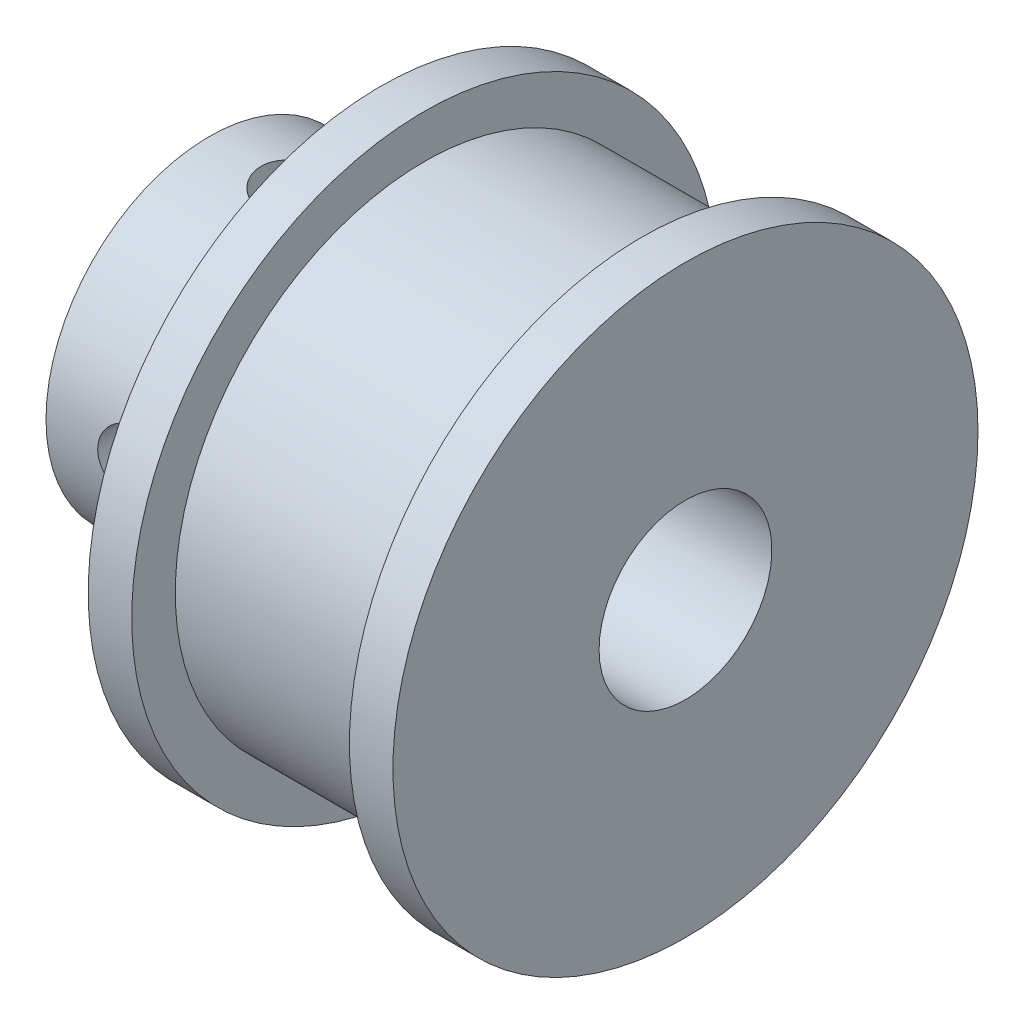
ISO-10303-21;
HEADER;
FILE_DESCRIPTION(('STEP AP214'),'2;1');
FILE_NAME('part.step','',(''),(''),'','','');
FILE_SCHEMA(('AUTOMOTIVE_DESIGN { 1 0 10303 214 1 1 1 1 }'));
ENDSEC;
DATA;
#1=APPLICATION_CONTEXT('core data for automotive mechanical design processes');
#2=APPLICATION_PROTOCOL_DEFINITION('international standard','automotive_design',2000,#1);
#3=PRODUCT_CONTEXT('',#1,'mechanical');
#4=PRODUCT('Part','Part','',(#3));
#5=PRODUCT_RELATED_PRODUCT_CATEGORY('part','',(#4));
#6=PRODUCT_DEFINITION_FORMATION('','',#4);
#7=PRODUCT_DEFINITION_CONTEXT('part definition',#1,'design');
#8=PRODUCT_DEFINITION('design','',#6,#7);
#9=PRODUCT_DEFINITION_SHAPE('','',#8);
#10=(LENGTH_UNIT() NAMED_UNIT(*) SI_UNIT(.MILLI.,.METRE.));
#11=(NAMED_UNIT(*) PLANE_ANGLE_UNIT() SI_UNIT($,.RADIAN.));
#12=(NAMED_UNIT(*) SI_UNIT($,.STERADIAN.) SOLID_ANGLE_UNIT());
#13=UNCERTAINTY_MEASURE_WITH_UNIT(LENGTH_MEASURE(1.E-05),#10,'distance_accuracy_value','');
#14=(GEOMETRIC_REPRESENTATION_CONTEXT(3) GLOBAL_UNCERTAINTY_ASSIGNED_CONTEXT((#13)) GLOBAL_UNIT_ASSIGNED_CONTEXT((#10,
#11,#12)) REPRESENTATION_CONTEXT('',''));
#15=CARTESIAN_POINT('',(0.,0.,0.));
#16=DIRECTION('',(0.,0.,1.));
#17=DIRECTION('',(1.,0.,0.));
#18=AXIS2_PLACEMENT_3D('',#15,#16,#17);
#19=CARTESIAN_POINT('',(6.3,0.,0.));
#20=DIRECTION('',(1.,0.,0.));
#21=DIRECTION('',(0.,0.,-1.));
#22=AXIS2_PLACEMENT_3D('',#19,#20,#21);
#23=CYLINDRICAL_SURFACE('',#22,10.75);
#24=CARTESIAN_POINT('',(6.3,0.,0.));
#25=DIRECTION('',(1.,0.,0.));
#26=DIRECTION('',(0.,0.,-1.));
#27=AXIS2_PLACEMENT_3D('',#24,#25,#26);
#28=CIRCLE('',#27,10.75);
#29=CARTESIAN_POINT('',(6.3,0.,-10.75));
#30=VERTEX_POINT('',#29);
#31=EDGE_CURVE('E54',#30,#30,#28,.T.);
#32=ORIENTED_EDGE('',*,*,#31,.T.);
#33=EDGE_LOOP('',(#32));
#34=FACE_BOUND('',#33,.T.);
#35=CARTESIAN_POINT('',(7.9,0.,0.));
#36=DIRECTION('',(1.,0.,0.));
#37=DIRECTION('',(0.,0.,-1.));
#38=AXIS2_PLACEMENT_3D('',#35,#36,#37);
#39=CIRCLE('',#38,10.75);
#40=CARTESIAN_POINT('',(7.9,0.,-10.75));
#41=VERTEX_POINT('',#40);
#42=EDGE_CURVE('E73',#41,#41,#39,.T.);
#43=ORIENTED_EDGE('',*,*,#42,.F.);
#44=EDGE_LOOP('',(#43));
#45=FACE_BOUND('',#44,.T.);
#46=ADVANCED_FACE('F44',(#34,#45),#23,.T.);
#47=CARTESIAN_POINT('',(6.3,10.75,0.));
#48=DIRECTION('',(-1.,0.,0.));
#49=DIRECTION('',(0.,0.,1.));
#50=AXIS2_PLACEMENT_3D('',#47,#48,#49);
#51=PLANE('',#50);
#52=CARTESIAN_POINT('',(6.3,0.,0.));
#53=DIRECTION('',(-1.,0.,0.));
#54=DIRECTION('',(0.,0.,1.));
#55=AXIS2_PLACEMENT_3D('',#52,#53,#54);
#56=CIRCLE('',#55,6.);
#57=CARTESIAN_POINT('',(6.3,0.,6.));
#58=VERTEX_POINT('',#57);
#59=EDGE_CURVE('E77',#58,#58,#56,.T.);
#60=ORIENTED_EDGE('',*,*,#59,.F.);
#61=EDGE_LOOP('',(#60));
#62=FACE_BOUND('',#61,.T.);
#63=ORIENTED_EDGE('',*,*,#31,.F.);
#64=EDGE_LOOP('',(#63));
#65=FACE_BOUND('',#64,.T.);
#66=ADVANCED_FACE('F126',(#62,#65),#51,.T.);
#67=CARTESIAN_POINT('',(17.5,0.,0.));
#68=DIRECTION('',(1.,0.,0.));
#69=DIRECTION('',(0.,0.,-1.));
#70=AXIS2_PLACEMENT_3D('',#67,#68,#69);
#71=PLANE('',#70);
#72=CARTESIAN_POINT('',(17.5,0.,0.));
#73=DIRECTION('',(-1.,0.,0.));
#74=DIRECTION('',(0.,0.,1.));
#75=AXIS2_PLACEMENT_3D('',#72,#73,#74);
#76=CIRCLE('',#75,3.17500000000001);
#77=CARTESIAN_POINT('',(17.5,0.,3.17500000000001));
#78=VERTEX_POINT('',#77);
#79=EDGE_CURVE('E80',#78,#78,#76,.T.);
#80=ORIENTED_EDGE('',*,*,#79,.T.);
#81=EDGE_LOOP('',(#80));
#82=FACE_BOUND('',#81,.T.);
#83=CARTESIAN_POINT('',(17.5,0.,0.));
#84=DIRECTION('',(1.,0.,0.));
#85=DIRECTION('',(0.,0.,-1.));
#86=AXIS2_PLACEMENT_3D('',#83,#84,#85);
#87=CIRCLE('',#86,10.75);
#88=CARTESIAN_POINT('',(17.5,0.,-10.75));
#89=VERTEX_POINT('',#88);
#90=EDGE_CURVE('E58',#89,#89,#87,.T.);
#91=ORIENTED_EDGE('',*,*,#90,.T.);
#92=EDGE_LOOP('',(#91));
#93=FACE_BOUND('',#92,.T.);
#94=ADVANCED_FACE('F130',(#82,#93),#71,.T.);
#95=CARTESIAN_POINT('',(6.3,0.,0.));
#96=DIRECTION('',(1.,0.,0.));
#97=DIRECTION('',(0.,0.,-1.));
#98=AXIS2_PLACEMENT_3D('',#95,#96,#97);
#99=CYLINDRICAL_SURFACE('',#98,10.75);
#100=CARTESIAN_POINT('',(15.9,0.,0.));
#101=DIRECTION('',(1.,0.,0.));
#102=DIRECTION('',(0.,0.,-1.));
#103=AXIS2_PLACEMENT_3D('',#100,#101,#102);
#104=CIRCLE('',#103,10.75);
#105=CARTESIAN_POINT('',(15.9,0.,-10.75));
#106=VERTEX_POINT('',#105);
#107=EDGE_CURVE('E62',#106,#106,#104,.T.);
#108=ORIENTED_EDGE('',*,*,#107,.T.);
#109=EDGE_LOOP('',(#108));
#110=FACE_BOUND('',#109,.T.);
#111=ORIENTED_EDGE('',*,*,#90,.F.);
#112=EDGE_LOOP('',(#111));
#113=FACE_BOUND('',#112,.T.);
#114=ADVANCED_FACE('F148',(#110,#113),#99,.T.);
#115=CARTESIAN_POINT('',(15.9,10.75,0.));
#116=DIRECTION('',(-1.,0.,0.));
#117=DIRECTION('',(0.,0.,1.));
#118=AXIS2_PLACEMENT_3D('',#115,#116,#117);
#119=PLANE('',#118);
#120=CARTESIAN_POINT('',(15.9,0.,0.));
#121=DIRECTION('',(1.,0.,0.));
#122=DIRECTION('',(0.,0.,-1.));
#123=AXIS2_PLACEMENT_3D('',#120,#121,#122);
#124=CIRCLE('',#123,9.15);
#125=CARTESIAN_POINT('',(15.9,0.,-9.15));
#126=VERTEX_POINT('',#125);
#127=EDGE_CURVE('E67',#126,#126,#124,.T.);
#128=ORIENTED_EDGE('',*,*,#127,.T.);
#129=EDGE_LOOP('',(#128));
#130=FACE_BOUND('',#129,.T.);
#131=ORIENTED_EDGE('',*,*,#107,.F.);
#132=EDGE_LOOP('',(#131));
#133=FACE_BOUND('',#132,.T.);
#134=ADVANCED_FACE('F142',(#130,#133),#119,.T.);
#135=CARTESIAN_POINT('',(6.3,0.,0.));
#136=DIRECTION('',(1.,0.,0.));
#137=DIRECTION('',(0.,0.,-1.));
#138=AXIS2_PLACEMENT_3D('',#135,#136,#137);
#139=CYLINDRICAL_SURFACE('',#138,9.15);
#140=CARTESIAN_POINT('',(7.9,0.,0.));
#141=DIRECTION('',(1.,0.,0.));
#142=DIRECTION('',(0.,0.,-1.));
#143=AXIS2_PLACEMENT_3D('',#140,#141,#142);
#144=CIRCLE('',#143,9.15);
#145=CARTESIAN_POINT('',(7.9,0.,-9.15));
#146=VERTEX_POINT('',#145);
#147=EDGE_CURVE('E70',#146,#146,#144,.T.);
#148=ORIENTED_EDGE('',*,*,#147,.T.);
#149=EDGE_LOOP('',(#148));
#150=FACE_BOUND('',#149,.T.);
#151=ORIENTED_EDGE('',*,*,#127,.F.);
#152=EDGE_LOOP('',(#151));
#153=FACE_BOUND('',#152,.T.);
#154=ADVANCED_FACE('F137',(#150,#153),#139,.T.);
#155=CARTESIAN_POINT('',(7.9,9.15000000000001,0.));
#156=DIRECTION('',(1.,0.,0.));
#157=DIRECTION('',(0.,0.,-1.));
#158=AXIS2_PLACEMENT_3D('',#155,#156,#157);
#159=PLANE('',#158);
#160=ORIENTED_EDGE('',*,*,#42,.T.);
#161=EDGE_LOOP('',(#160));
#162=FACE_BOUND('',#161,.T.);
#163=ORIENTED_EDGE('',*,*,#147,.F.);
#164=EDGE_LOOP('',(#163));
#165=FACE_BOUND('',#164,.T.);
#166=ADVANCED_FACE('F121',(#162,#165),#159,.T.);
#167=CARTESIAN_POINT('',(0.,0.,0.));
#168=DIRECTION('',(1.,0.,0.));
#169=DIRECTION('',(0.,0.,-1.));
#170=AXIS2_PLACEMENT_3D('',#167,#168,#169);
#171=CYLINDRICAL_SURFACE('',#170,6.);
#172=CARTESIAN_POINT('',(3.15,-1.24999999999999,5.86834729715276));
#173=CARTESIAN_POINT('',(3.08060938484897,-1.24999750877598,5.86834869213646));
#174=CARTESIAN_POINT('',(3.01118802798478,-1.24420229433947,5.86959145924544));
#175=CARTESIAN_POINT('',(2.87431368268276,-1.22119649233777,5.87442015581798));
#176=CARTESIAN_POINT('',(2.80686224449358,-1.2039771544034,5.87800788138389));
#177=CARTESIAN_POINT('',(2.67592762716514,-1.15868397507228,5.88710292961931));
#178=CARTESIAN_POINT('',(2.6124404040082,-1.13062141248931,5.89260825706945));
#179=CARTESIAN_POINT('',(2.49107550035441,-1.06446988601731,5.90491581335742));
#180=CARTESIAN_POINT('',(2.43319759326999,-1.02638132735819,5.91171798977623));
#181=CARTESIAN_POINT('',(2.32380462484655,-0.940636399466074,5.92596934661468));
#182=CARTESIAN_POINT('',(2.27238810637354,-0.892855554869662,5.93342614373039));
#183=CARTESIAN_POINT('',(2.17823893135191,-0.789351223880631,5.94807966802575));
#184=CARTESIAN_POINT('',(2.13550691170858,-0.733627155455996,5.95527637609915));
#185=CARTESIAN_POINT('',(2.05955411191716,-0.615162052999584,5.96868135118849));
#186=CARTESIAN_POINT('',(2.02642747353675,-0.552359428204939,5.97487958631243));
#187=CARTESIAN_POINT('',(1.97123394714024,-0.42192855100672,5.98550347343302));
#188=CARTESIAN_POINT('',(1.94916593484649,-0.35430078995059,5.98992930561222));
#189=CARTESIAN_POINT('',(1.91702423888255,-0.217162904200503,5.99645589892178));
#190=CARTESIAN_POINT('',(1.90678398280485,-0.14769338091636,5.99858891959926));
#191=CARTESIAN_POINT('',(1.898068304243,-0.00799184883952966,6.00040112580612));
#192=CARTESIAN_POINT('',(1.89959165580692,0.0622400797368324,6.0000805670369));
#193=CARTESIAN_POINT('',(1.91423460095677,0.200326586199567,5.99704658090511));
#194=CARTESIAN_POINT('',(1.92717471895813,0.268201128726472,5.99437018956584));
#195=CARTESIAN_POINT('',(1.96399862533132,0.400793746289752,5.98696720898885));
#196=CARTESIAN_POINT('',(1.98788287720309,0.465511687511021,5.98224053291904));
#197=CARTESIAN_POINT('',(2.04608005212551,0.590460005384681,5.97120767323923));
#198=CARTESIAN_POINT('',(2.08046229420967,0.650657134981646,5.96489104125346));
#199=CARTESIAN_POINT('',(2.15862800284042,0.764493456510639,5.95137300440189));
#200=CARTESIAN_POINT('',(2.20241263820614,0.818131831816406,5.94417148958325));
#201=CARTESIAN_POINT('',(2.29912162489107,0.918394203276898,5.92951700233276));
#202=CARTESIAN_POINT('',(2.35220305998195,0.964866487494782,5.92206184975926));
#203=CARTESIAN_POINT('',(2.4654820489948,1.04827597240487,5.90786872648996));
#204=CARTESIAN_POINT('',(2.52567976138724,1.08521296069979,5.9011307717716));
#205=CARTESIAN_POINT('',(2.6517122548288,1.14856217138453,5.88912998409155));
#206=CARTESIAN_POINT('',(2.71756065069344,1.17494805489726,5.88387085232125));
#207=CARTESIAN_POINT('',(2.85289161936939,1.21623577538671,5.87547606410361));
#208=CARTESIAN_POINT('',(2.9223736728081,1.23113924882347,5.87234010507183));
#209=CARTESIAN_POINT('',(3.06161970631891,1.24880863867016,5.86860783239132));
#210=CARTESIAN_POINT('',(3.13135458453704,1.25179442917997,5.86796551863475));
#211=CARTESIAN_POINT('',(3.27032581154015,1.24613693439293,5.86916952018704));
#212=CARTESIAN_POINT('',(3.33956219090234,1.23749436857862,5.87101568152624));
#213=CARTESIAN_POINT('',(3.47482051605812,1.20901558325483,5.87694538226167));
#214=CARTESIAN_POINT('',(3.54086866717883,1.1892984137687,5.88100511282998));
#215=CARTESIAN_POINT('',(3.6687239894416,1.13935810860918,5.8908833850312));
#216=CARTESIAN_POINT('',(3.73053078565039,1.10913404556145,5.89670208191057));
#217=CARTESIAN_POINT('',(3.84910644121622,1.03854598181483,5.90954501937191));
#218=CARTESIAN_POINT('',(3.90579220446616,0.998045327353951,5.91658506648323));
#219=CARTESIAN_POINT('',(4.01164324915505,0.908234440569869,5.93103483993908));
#220=CARTESIAN_POINT('',(4.06080768623921,0.858923220505159,5.93844460766532));
#221=CARTESIAN_POINT('',(4.15106271309715,0.751900450843326,5.95294924316737));
#222=CARTESIAN_POINT('',(4.19200409502637,0.694061907614543,5.9600367471991));
#223=CARTESIAN_POINT('',(4.26358875208797,0.572200102216354,5.97296708772407));
#224=CARTESIAN_POINT('',(4.29423248223743,0.508177113476874,5.97880997920819));
#225=CARTESIAN_POINT('',(4.34413867931733,0.376142117847913,5.98856148270679));
#226=CARTESIAN_POINT('',(4.36346916554433,0.308156710970192,5.99248163136497));
#227=CARTESIAN_POINT('',(4.39041440400808,0.169813400503473,5.99799561410226));
#228=CARTESIAN_POINT('',(4.39803069353271,0.0994558094616958,5.99958975342889));
#229=CARTESIAN_POINT('',(4.40126762204849,-0.0402133434703388,6.00026408056941));
#230=CARTESIAN_POINT('',(4.39711189999471,-0.109519592177922,5.99939113754811));
#231=CARTESIAN_POINT('',(4.37741936134706,-0.246422870373554,5.99532874094472));
#232=CARTESIAN_POINT('',(4.36188271359322,-0.314019925202705,5.99213932172838));
#233=CARTESIAN_POINT('',(4.31997220535143,-0.445431965492052,5.98380460077543));
#234=CARTESIAN_POINT('',(4.29362733614688,-0.50925655000452,5.97866453407556));
#235=CARTESIAN_POINT('',(4.23087760226799,-0.631610567220736,5.96697995347704));
#236=CARTESIAN_POINT('',(4.19447186165686,-0.690139538279506,5.96043531730246));
#237=CARTESIAN_POINT('',(4.11189033200669,-0.801340321298256,5.94651596786387));
#238=CARTESIAN_POINT('',(4.06555571194329,-0.853892633615919,5.93912880302851));
#239=CARTESIAN_POINT('',(3.9647554990029,-0.950552741980373,5.9244278681135));
#240=CARTESIAN_POINT('',(3.91028797005155,-0.994658521571218,5.91711411595369));
#241=CARTESIAN_POINT('',(3.79399089756654,-1.07367451852766,5.90329191643328));
#242=CARTESIAN_POINT('',(3.73208158853789,-1.10846928126992,5.89679406702551));
#243=CARTESIAN_POINT('',(3.60317484391673,-1.16710627925305,5.88547039658063));
#244=CARTESIAN_POINT('',(3.53618195154699,-1.19095816292459,5.88064310352601));
#245=CARTESIAN_POINT('',(3.41589371843156,-1.2225655413186,5.87414004405196));
#246=CARTESIAN_POINT('',(3.36327046340694,-1.23283449005669,5.87198163591589));
#247=CARTESIAN_POINT('',(3.25710421947899,-1.24655254358403,5.86908475266778));
#248=CARTESIAN_POINT('',(3.20356126768996,-1.25000192292739,5.86834622039194));
#249=CARTESIAN_POINT('',(3.15,-1.24999999999999,5.86834729715276));
#250=B_SPLINE_CURVE_WITH_KNOTS('',3,(#172,#173,#174,#175,#176,#177,#178,#179,#180,#181,#182,
#183,#184,#185,#186,#187,#188,#189,#190,#191,#192,#193,#194,#195,#196,#197,#198,#199,#200,#201,
#202,#203,#204,#205,#206,#207,#208,#209,#210,#211,#212,#213,#214,#215,#216,#217,#218,#219,#220,
#221,#222,#223,#224,#225,#226,#227,#228,#229,#230,#231,#232,#233,#234,#235,#236,#237,#238,#239,
#240,#241,#242,#243,#244,#245,#246,#247,#248,#249),.UNSPECIFIED.,.T.,.F.,(4,2,2,2,2,2,2,2,2,2,2,
2,2,2,2,2,2,2,2,2,2,2,2,2,2,2,2,2,2,2,2,2,2,2,2,2,2,2,4),(0.,0.207975654071266,
0.416110792417464,0.624030014802721,0.831940834815781,1.04271333467883,1.25350128663872,
1.46629026266842,1.67905760106931,1.88879048859262,2.09850151896336,2.30497341416458,
2.51145405455868,2.71932871977946,2.92722924104256,3.13905862244909,3.35089272191624,
3.56325237332483,3.77558175387593,3.98397516009788,4.19235567296519,4.39853786231918,
4.60473825464025,4.81383917934645,5.0229635608218,5.23559458753337,5.44821621759034,
5.65954599648527,5.87084803959574,6.07816293922638,6.28547476332974,6.49223410585093,
6.69901145528165,6.90938318978565,7.11980508427527,7.33272651358115,7.54545984571979,
7.7059986758576,7.86653104261152),.UNSPECIFIED.);
#251=CARTESIAN_POINT('',(3.15,-1.24999999999999,5.86834729715276));
#252=VERTEX_POINT('',#251);
#253=EDGE_CURVE('E94',#252,#252,#250,.T.);
#254=ORIENTED_EDGE('',*,*,#253,.T.);
#255=EDGE_LOOP('',(#254));
#256=FACE_BOUND('',#255,.T.);
#257=CARTESIAN_POINT('',(3.15,5.86834729715276,-1.24999999999999));
#258=CARTESIAN_POINT('',(3.21939061515103,5.86834869213646,-1.24999750877598));
#259=CARTESIAN_POINT('',(3.28881197201522,5.86959145924544,-1.24420229433947));
#260=CARTESIAN_POINT('',(3.42568631731725,5.87442015581798,-1.22119649233777));
#261=CARTESIAN_POINT('',(3.49313775550643,5.87800788138389,-1.2039771544034));
#262=CARTESIAN_POINT('',(3.62407237283487,5.88710292961931,-1.15868397507228));
#263=CARTESIAN_POINT('',(3.68755959599181,5.89260825706945,-1.13062141248931));
#264=CARTESIAN_POINT('',(3.8089244996456,5.90491581335742,-1.06446988601731));
#265=CARTESIAN_POINT('',(3.86680240673001,5.91171798977623,-1.02638132735819));
#266=CARTESIAN_POINT('',(3.97619537515345,5.92596934661468,-0.940636399466074));
#267=CARTESIAN_POINT('',(4.02761189362646,5.93342614373039,-0.892855554869663));
#268=CARTESIAN_POINT('',(4.12176106864809,5.94807966802575,-0.789351223880632));
#269=CARTESIAN_POINT('',(4.16449308829142,5.95527637609915,-0.733627155455996));
#270=CARTESIAN_POINT('',(4.24044588808284,5.96868135118848,-0.615162052999584));
#271=CARTESIAN_POINT('',(4.27357252646325,5.97487958631242,-0.55235942820494));
#272=CARTESIAN_POINT('',(4.32876605285976,5.98550347343303,-0.42192855100672));
#273=CARTESIAN_POINT('',(4.35083406515351,5.98992930561223,-0.354300789950591));
#274=CARTESIAN_POINT('',(4.38297576111745,5.99645589892179,-0.217162904200503));
#275=CARTESIAN_POINT('',(4.39321601719515,5.99858891959926,-0.14769338091636));
#276=CARTESIAN_POINT('',(4.40193169575701,6.00040112580612,-0.00799184883952913));
#277=CARTESIAN_POINT('',(4.40040834419309,6.0000805670369,0.0622400797368331));
#278=CARTESIAN_POINT('',(4.38576539904325,5.99704658090511,0.200326586199567));
#279=CARTESIAN_POINT('',(4.37282528104187,5.99437018956585,0.268201128726471));
#280=CARTESIAN_POINT('',(4.33600137466868,5.98696720898885,0.40079374628975));
#281=CARTESIAN_POINT('',(4.31211712279691,5.98224053291904,0.465511687511021));
#282=CARTESIAN_POINT('',(4.25391994787449,5.97120767323923,0.590460005384682));
#283=CARTESIAN_POINT('',(4.21953770579033,5.96489104125346,0.650657134981647));
#284=CARTESIAN_POINT('',(4.14137199715957,5.95137300440189,0.76449345651064));
#285=CARTESIAN_POINT('',(4.09758736179386,5.94417148958325,0.818131831816406));
#286=CARTESIAN_POINT('',(4.00087837510893,5.92951700233276,0.918394203276898));
#287=CARTESIAN_POINT('',(3.94779694001805,5.92206184975926,0.964866487494782));
#288=CARTESIAN_POINT('',(3.8345179510052,5.90786872648996,1.04827597240487));
#289=CARTESIAN_POINT('',(3.77432023861276,5.9011307717716,1.08521296069979));
#290=CARTESIAN_POINT('',(3.6482877451712,5.88912998409155,1.14856217138453));
#291=CARTESIAN_POINT('',(3.58243934930656,5.88387085232125,1.17494805489726));
#292=CARTESIAN_POINT('',(3.44710838063061,5.87547606410361,1.21623577538671));
#293=CARTESIAN_POINT('',(3.3776263271919,5.87234010507183,1.23113924882347));
#294=CARTESIAN_POINT('',(3.23838029368109,5.86860783239132,1.24880863867016));
#295=CARTESIAN_POINT('',(3.16864541546296,5.86796551863475,1.25179442917997));
#296=CARTESIAN_POINT('',(3.02967418845985,5.86916952018704,1.24613693439293));
#297=CARTESIAN_POINT('',(2.96043780909766,5.87101568152624,1.23749436857862));
#298=CARTESIAN_POINT('',(2.82517948394188,5.87694538226167,1.20901558325483));
#299=CARTESIAN_POINT('',(2.75913133282117,5.88100511282998,1.1892984137687));
#300=CARTESIAN_POINT('',(2.6312760105584,5.8908833850312,1.13935810860918));
#301=CARTESIAN_POINT('',(2.56946921434961,5.89670208191057,1.10913404556145));
#302=CARTESIAN_POINT('',(2.45089355878378,5.90954501937191,1.03854598181483));
#303=CARTESIAN_POINT('',(2.39420779553384,5.91658506648323,0.998045327353952));
#304=CARTESIAN_POINT('',(2.28835675084495,5.93103483993908,0.908234440569869));
#305=CARTESIAN_POINT('',(2.23919231376079,5.93844460766532,0.858923220505158));
#306=CARTESIAN_POINT('',(2.14893728690285,5.95294924316737,0.751900450843326));
#307=CARTESIAN_POINT('',(2.10799590497363,5.9600367471991,0.694061907614543));
#308=CARTESIAN_POINT('',(2.03641124791203,5.97296708772407,0.572200102216354));
#309=CARTESIAN_POINT('',(2.00576751776257,5.97880997920819,0.508177113476874));
#310=CARTESIAN_POINT('',(1.95586132068267,5.98856148270679,0.376142117847913));
#311=CARTESIAN_POINT('',(1.93653083445567,5.99248163136497,0.308156710970192));
#312=CARTESIAN_POINT('',(1.90958559599192,5.99799561410226,0.169813400503473));
#313=CARTESIAN_POINT('',(1.90196930646729,5.99958975342889,0.099455809461696));
#314=CARTESIAN_POINT('',(1.89873237795151,6.00026408056941,-0.0402133434703388));
#315=CARTESIAN_POINT('',(1.90288810000529,5.99939113754811,-0.109519592177922));
#316=CARTESIAN_POINT('',(1.92258063865294,5.99532874094472,-0.246422870373554));
#317=CARTESIAN_POINT('',(1.93811728640678,5.99213932172838,-0.314019925202705));
#318=CARTESIAN_POINT('',(1.98002779464857,5.98380460077543,-0.445431965492052));
#319=CARTESIAN_POINT('',(2.00637266385312,5.97866453407556,-0.509256550004521));
#320=CARTESIAN_POINT('',(2.06912239773201,5.96697995347705,-0.631610567220736));
#321=CARTESIAN_POINT('',(2.10552813834314,5.96043531730246,-0.690139538279507));
#322=CARTESIAN_POINT('',(2.18810966799331,5.94651596786387,-0.801340321298256));
#323=CARTESIAN_POINT('',(2.23444428805671,5.93912880302851,-0.85389263361592));
#324=CARTESIAN_POINT('',(2.3352445009971,5.9244278681135,-0.950552741980374));
#325=CARTESIAN_POINT('',(2.38971202994845,5.91711411595369,-0.994658521571218));
#326=CARTESIAN_POINT('',(2.50600910243346,5.90329191643328,-1.07367451852766));
#327=CARTESIAN_POINT('',(2.56791841146211,5.89679406702551,-1.10846928126993));
#328=CARTESIAN_POINT('',(2.69682515608327,5.88547039658063,-1.16710627925305));
#329=CARTESIAN_POINT('',(2.76381804845301,5.88064310352601,-1.19095816292459));
#330=CARTESIAN_POINT('',(2.88410628156844,5.87414004405196,-1.2225655413186));
#331=CARTESIAN_POINT('',(2.93672953659306,5.87198163591589,-1.23283449005669));
#332=CARTESIAN_POINT('',(3.04289578052101,5.86908475266778,-1.24655254358403));
#333=CARTESIAN_POINT('',(3.09643873231005,5.86834622039194,-1.2500019229274));
#334=CARTESIAN_POINT('',(3.15,5.86834729715276,-1.24999999999999));
#335=B_SPLINE_CURVE_WITH_KNOTS('',3,(#257,#258,#259,#260,#261,#262,#263,#264,#265,#266,#267,
#268,#269,#270,#271,#272,#273,#274,#275,#276,#277,#278,#279,#280,#281,#282,#283,#284,#285,#286,
#287,#288,#289,#290,#291,#292,#293,#294,#295,#296,#297,#298,#299,#300,#301,#302,#303,#304,#305,
#306,#307,#308,#309,#310,#311,#312,#313,#314,#315,#316,#317,#318,#319,#320,#321,#322,#323,#324,
#325,#326,#327,#328,#329,#330,#331,#332,#333,#334),.UNSPECIFIED.,.T.,.F.,(4,2,2,2,2,2,2,2,2,2,2,
2,2,2,2,2,2,2,2,2,2,2,2,2,2,2,2,2,2,2,2,2,2,2,2,2,2,2,4),(0.,0.207975654071274,
0.416110792417478,0.624030014802728,0.831940834815782,1.04271333467883,1.25350128663872,
1.46629026266842,1.67905760106931,1.88879048859262,2.09850151896336,2.30497341416459,
2.51145405455868,2.71932871977946,2.92722924104256,3.1390586224491,3.35089272191624,
3.56325237332484,3.77558175387593,3.98397516009788,4.1923556729652,4.39853786231918,
4.60473825464026,4.81383917934646,5.0229635608218,5.23559458753338,5.44821621759034,
5.65954599648528,5.87084803959574,6.07816293922638,6.28547476332975,6.49223410585094,
6.69901145528166,6.90938318978566,7.11980508427528,7.33272651358115,7.5454598457198,
7.70599867585761,7.86653104261152),.UNSPECIFIED.);
#336=CARTESIAN_POINT('',(3.15,5.86834729715276,-1.24999999999999));
#337=VERTEX_POINT('',#336);
#338=EDGE_CURVE('E88',#337,#337,#335,.T.);
#339=ORIENTED_EDGE('',*,*,#338,.T.);
#340=EDGE_LOOP('',(#339));
#341=FACE_BOUND('',#340,.T.);
#342=CARTESIAN_POINT('',(0.,0.,0.));
#343=DIRECTION('',(-1.,0.,0.));
#344=DIRECTION('',(0.,0.,1.));
#345=AXIS2_PLACEMENT_3D('',#342,#343,#344);
#346=CIRCLE('',#345,6.);
#347=CARTESIAN_POINT('',(0.,0.,6.));
#348=VERTEX_POINT('',#347);
#349=EDGE_CURVE('E76',#348,#348,#346,.T.);
#350=ORIENTED_EDGE('',*,*,#349,.F.);
#351=EDGE_LOOP('',(#350));
#352=FACE_BOUND('',#351,.T.);
#353=ORIENTED_EDGE('',*,*,#59,.T.);
#354=EDGE_LOOP('',(#353));
#355=FACE_BOUND('',#354,.T.);
#356=ADVANCED_FACE('F99',(#256,#341,#352,#355),#171,.T.);
#357=CARTESIAN_POINT('',(0.,0.,0.));
#358=DIRECTION('',(-1.,0.,0.));
#359=DIRECTION('',(0.,0.,1.));
#360=AXIS2_PLACEMENT_3D('',#357,#358,#359);
#361=PLANE('',#360);
#362=CARTESIAN_POINT('',(0.,0.,0.));
#363=DIRECTION('',(-1.,0.,0.));
#364=DIRECTION('',(0.,0.,1.));
#365=AXIS2_PLACEMENT_3D('',#362,#363,#364);
#366=CIRCLE('',#365,3.17500000000001);
#367=CARTESIAN_POINT('',(0.,0.,3.17500000000001));
#368=VERTEX_POINT('',#367);
#369=EDGE_CURVE('E85',#368,#368,#366,.T.);
#370=ORIENTED_EDGE('',*,*,#369,.F.);
#371=EDGE_LOOP('',(#370));
#372=FACE_BOUND('',#371,.T.);
#373=ORIENTED_EDGE('',*,*,#349,.T.);
#374=EDGE_LOOP('',(#373));
#375=FACE_BOUND('',#374,.T.);
#376=ADVANCED_FACE('F114',(#372,#375),#361,.T.);
#377=CARTESIAN_POINT('',(0.,0.,0.));
#378=DIRECTION('',(-1.,0.,0.));
#379=DIRECTION('',(0.,0.,1.));
#380=AXIS2_PLACEMENT_3D('',#377,#378,#379);
#381=CYLINDRICAL_SURFACE('',#380,3.17500000000001);
#382=CARTESIAN_POINT('',(4.39999999999999,0.,3.17500000000001));
#383=CARTESIAN_POINT('',(4.39999313722549,0.0672847316330935,3.17499501338286));
#384=CARTESIAN_POINT('',(4.39453640694495,0.134670364060802,3.17283650663752));
#385=CARTESIAN_POINT('',(4.37289647154285,0.26754236903161,3.1644125052198));
#386=CARTESIAN_POINT('',(4.35668587477846,0.333023444641003,3.15813652319776));
#387=CARTESIAN_POINT('',(4.31421702221288,0.459957962416118,3.14215557601543));
#388=CARTESIAN_POINT('',(4.28799048784793,0.521423409993964,3.13246144382692));
#389=CARTESIAN_POINT('',(4.22635909158925,0.639031646406584,3.11060223187219));
#390=CARTESIAN_POINT('',(4.19095703225619,0.695176053354683,3.09843790684372));
#391=CARTESIAN_POINT('',(4.1102623178802,0.803199302091194,3.07224897424455));
#392=CARTESIAN_POINT('',(4.06461804491262,0.854801684849633,3.05816785515033));
#393=CARTESIAN_POINT('',(3.96547692125207,0.949851027050091,3.02999513494301));
#394=CARTESIAN_POINT('',(3.91197647170956,0.993294227940909,3.01590353198658));
#395=CARTESIAN_POINT('',(3.7958575975591,1.07262244667805,2.98863572549246));
#396=CARTESIAN_POINT('',(3.73294685556461,1.10810421355731,2.97552454842957));
#397=CARTESIAN_POINT('',(3.601455972126,1.16785949338491,2.95258553832486));
#398=CARTESIAN_POINT('',(3.5328784371077,1.1921381257227,2.94275620617847));
#399=CARTESIAN_POINT('',(3.39517542459277,1.22768807019403,2.92809906106055));
#400=CARTESIAN_POINT('',(3.32620861663799,1.23948765338749,2.92306908743275));
#401=CARTESIAN_POINT('',(3.18710461326819,1.25139521634012,2.91799267608067));
#402=CARTESIAN_POINT('',(3.11696798518786,1.2515087076257,2.9179438890731));
#403=CARTESIAN_POINT('',(2.98252735387378,1.24044215294952,2.92266241514436));
#404=CARTESIAN_POINT('',(2.91814756611622,1.23001876389829,2.92710705556642));
#405=CARTESIAN_POINT('',(2.79213792936048,1.19943319152663,2.93977143360489));
#406=CARTESIAN_POINT('',(2.73050854584048,1.17926936651211,2.94799180758786));
#407=CARTESIAN_POINT('',(2.61029050121679,1.12939589279821,2.96745955492871));
#408=CARTESIAN_POINT('',(2.55178759301476,1.09950293840842,2.97876432051875));
#409=CARTESIAN_POINT('',(2.44041816809346,1.03114819003906,3.00311044973731));
#410=CARTESIAN_POINT('',(2.38755373652611,0.992683242204216,3.01615245182718));
#411=CARTESIAN_POINT('',(2.28480776207774,0.904898473117776,3.04369028436774));
#412=CARTESIAN_POINT('',(2.23544379942134,0.854982538626516,3.05822195069567));
#413=CARTESIAN_POINT('',(2.14562478708672,0.747422600693464,3.08627133748349));
#414=CARTESIAN_POINT('',(2.10517140287854,0.689777155767928,3.09978886808116));
#415=CARTESIAN_POINT('',(2.03367114989499,0.566964697663747,3.12460676760531));
#416=CARTESIAN_POINT('',(2.00281323038136,0.501677729871145,3.1358612225892));
#417=CARTESIAN_POINT('',(1.95269497302888,0.366284378650621,3.15453954285869));
#418=CARTESIAN_POINT('',(1.93342893447018,0.2961803830989,3.16196529078973));
#419=CARTESIAN_POINT('',(1.90807473477159,0.15748598181363,3.17180954080985));
#420=CARTESIAN_POINT('',(1.90129065188501,0.0890414587092488,3.17449212502601));
#421=CARTESIAN_POINT('',(1.89904537080421,-0.0480536320474774,3.17537559014031));
#422=CARTESIAN_POINT('',(1.90358135004103,-0.116704144074909,3.17357758823771));
#423=CARTESIAN_POINT('',(1.92333110126171,-0.249146112043382,3.16587519342691));
#424=CARTESIAN_POINT('',(1.93807478196562,-0.313019327348949,3.1601516850921));
#425=CARTESIAN_POINT('',(1.97718711597469,-0.437330047990826,3.14535985768855));
#426=CARTESIAN_POINT('',(2.00155701113697,-0.497767108885045,3.13629110706732));
#427=CARTESIAN_POINT('',(2.06002222605797,-0.61555064469223,3.1153508325338));
#428=CARTESIAN_POINT('',(2.09439015153061,-0.672747743207496,3.1034026288189));
#429=CARTESIAN_POINT('',(2.17157207357277,-0.780761917259367,3.0780057601295));
#430=CARTESIAN_POINT('',(2.21438939397395,-0.831576469108142,3.06455650557749));
#431=CARTESIAN_POINT('',(2.31047034254705,-0.928791348114851,3.03655938998591));
#432=CARTESIAN_POINT('',(2.36422706413393,-0.974701227513616,3.02199629492692));
#433=CARTESIAN_POINT('',(2.47894725017833,-1.05696284943213,2.99421855171025));
#434=CARTESIAN_POINT('',(2.53991174782692,-1.09331321924023,2.98100409737913));
#435=CARTESIAN_POINT('',(2.6681222536474,-1.15559997165607,2.95742074651156));
#436=CARTESIAN_POINT('',(2.73541540406842,-1.18144907129596,2.94707591747581));
#437=CARTESIAN_POINT('',(2.87392740472631,-1.2212562072246,2.93080697789356));
#438=CARTESIAN_POINT('',(2.94514344431734,-1.23522264211379,2.92487974538277));
#439=CARTESIAN_POINT('',(3.08410594497105,-1.25007804085777,2.91855940228498));
#440=CARTESIAN_POINT('',(3.15174613466061,-1.2518143056183,2.91780781401762));
#441=CARTESIAN_POINT('',(3.28630422020404,-1.24437120429059,2.92098982763326));
#442=CARTESIAN_POINT('',(3.35322220018166,-1.23519312367105,2.92492287776944));
#443=CARTESIAN_POINT('',(3.48189792826406,-1.20686591196944,2.93671925445628));
#444=CARTESIAN_POINT('',(3.54375501532457,-1.18809939057282,2.94443133408292));
#445=CARTESIAN_POINT('',(3.66347017893292,-1.14148049607647,2.96281485611588));
#446=CARTESIAN_POINT('',(3.7213271948703,-1.11362572435809,2.97348707966733));
#447=CARTESIAN_POINT('',(3.83493253525531,-1.04781462002772,2.99733186522454));
#448=CARTESIAN_POINT('',(3.89038076243783,-1.00937948877752,3.01061106475903));
#449=CARTESIAN_POINT('',(3.99431012178222,-0.924206507043667,3.03783875276751));
#450=CARTESIAN_POINT('',(4.04278881023169,-0.877465757163227,3.05178747371866));
#451=CARTESIAN_POINT('',(4.13448412183164,-0.77355319607798,3.07982295515275));
#452=CARTESIAN_POINT('',(4.17718690041992,-0.715913819660179,3.09386447942526));
#453=CARTESIAN_POINT('',(4.25230545950013,-0.593766403796395,3.11960779538582));
#454=CARTESIAN_POINT('',(4.28471987064719,-0.529257451559139,3.13130927554577));
#455=CARTESIAN_POINT('',(4.33582459900063,-0.400855491445669,3.15020502613285));
#456=CARTESIAN_POINT('',(4.35544733182244,-0.337376283301314,3.15769788512326));
#457=CARTESIAN_POINT('',(4.38436385215672,-0.207895662632504,3.16884766902596));
#458=CARTESIAN_POINT('',(4.39368602857975,-0.141901703524201,3.17251513536218));
#459=CARTESIAN_POINT('',(4.39923864615946,-0.0504531001608362,3.17470085654946));
#460=CARTESIAN_POINT('',(4.4000025737313,-0.0252336457199427,3.17500187012013));
#461=CARTESIAN_POINT('',(4.39999999999999,0.,3.17500000000001));
#462=B_SPLINE_CURVE_WITH_KNOTS('',3,(#382,#383,#384,#385,#386,#387,#388,#389,#390,#391,#392,
#393,#394,#395,#396,#397,#398,#399,#400,#401,#402,#403,#404,#405,#406,#407,#408,#409,#410,#411,
#412,#413,#414,#415,#416,#417,#418,#419,#420,#421,#422,#423,#424,#425,#426,#427,#428,#429,#430,
#431,#432,#433,#434,#435,#436,#437,#438,#439,#440,#441,#442,#443,#444,#445,#446,#447,#448,#449,
#450,#451,#452,#453,#454,#455,#456,#457,#458,#459,#460,#461),.UNSPECIFIED.,.T.,.F.,(4,2,2,2,2,2,
2,2,2,2,2,2,2,2,2,2,2,2,2,2,2,2,2,2,2,2,2,2,2,2,2,2,2,2,2,2,2,2,2,4),(0.,0.201779437744551,
0.404074820308131,0.605734757050766,0.807333171478418,1.01735976436243,1.2274828705813,
1.44660259463331,1.66562209023743,1.87494520835712,2.08416960269574,2.27936669865591,
2.47459670544106,2.67374147234742,2.87295963102293,3.08705517744557,3.30119070642572,
3.51930901537432,3.73731996902135,3.94275765182501,4.14814411546711,4.34465147529726,
4.54118419440116,4.74367898219937,4.94625358697286,5.16178927354868,5.3773558934051,
5.59467927329233,5.81184892233297,6.01381057507246,6.21574844354764,6.41019345194808,
6.60468982086284,6.81009090996544,7.015563843617,7.23379876986557,7.45206273023336,
7.6517726129909,7.85093070050891,7.92660360165653),.UNSPECIFIED.);
#463=CARTESIAN_POINT('',(4.39999999999999,0.,3.17500000000001));
#464=VERTEX_POINT('',#463);
#465=EDGE_CURVE('E209',#464,#464,#462,.T.);
#466=ORIENTED_EDGE('',*,*,#465,.T.);
#467=EDGE_LOOP('',(#466));
#468=FACE_BOUND('',#467,.T.);
#469=CARTESIAN_POINT('',(3.15,2.91858270398493,-1.25000000000003));
#470=CARTESIAN_POINT('',(3.08294123229726,2.9185891955252,-1.24999286392002));
#471=CARTESIAN_POINT('',(3.01578223008696,2.92092645038723,-1.24457161253239));
#472=CARTESIAN_POINT('',(2.88338490291026,2.92998517442322,-1.22308580115408));
#473=CARTESIAN_POINT('',(2.81815204136178,2.93671805691525,-1.20699353198017));
#474=CARTESIAN_POINT('',(2.69174429366685,2.95367783504785,-1.16486992778128));
#475=CARTESIAN_POINT('',(2.63055538660673,2.96389181028402,-1.13887530486567));
#476=CARTESIAN_POINT('',(2.51342244901655,2.98664490940933,-1.07779173231122));
#477=CARTESIAN_POINT('',(2.457477155973,2.99918347142757,-1.0427049794983));
#478=CARTESIAN_POINT('',(2.34928810981602,3.02595080926507,-0.962353829492934));
#479=CARTESIAN_POINT('',(2.29737118542084,3.04023283739073,-0.916666915264528));
#480=CARTESIAN_POINT('',(2.20169830158588,3.06843728874989,-0.81730231414645));
#481=CARTESIAN_POINT('',(2.15794514814842,3.08235958692785,-0.763621891133187));
#482=CARTESIAN_POINT('',(2.07823650216285,3.10891201177463,-0.647285797062998));
#483=CARTESIAN_POINT('',(2.04264055733132,3.12147292007292,-0.584366556004024));
#484=CARTESIAN_POINT('',(1.98267685931948,3.14324422109988,-0.452850465301547));
#485=CARTESIAN_POINT('',(1.95830467199885,3.15245593668201,-0.384255870461462));
#486=CARTESIAN_POINT('',(1.92263981745294,3.16611423056326,-0.246760897173893));
#487=CARTESIAN_POINT('',(1.91078557382548,3.17076466636065,-0.178026840226488));
#488=CARTESIAN_POINT('',(1.89868711033909,3.17551190440969,-0.03939830093477));
#489=CARTESIAN_POINT('',(1.89843870057772,3.1756103500067,0.0304957535146275));
#490=CARTESIAN_POINT('',(1.90924611114995,3.17136802875333,0.165409649899382));
#491=CARTESIAN_POINT('',(1.91968721723701,3.16726865978233,0.230487686315576));
#492=CARTESIAN_POINT('',(1.95053467407366,3.15541444614499,0.357881536818983));
#493=CARTESIAN_POINT('',(1.97094175406316,3.14765933397852,0.42019714840734));
#494=CARTESIAN_POINT('',(2.02139441645823,3.12910832817149,0.541410179653866));
#495=CARTESIAN_POINT('',(2.0515796827152,3.11826866169306,0.600242482304684));
#496=CARTESIAN_POINT('',(2.1206029636023,3.09462975143762,0.712157346885297));
#497=CARTESIAN_POINT('',(2.15944390282581,3.08182984578999,0.765237956392508));
#498=CARTESIAN_POINT('',(2.24756817996653,3.05461022779039,0.867739124124563));
#499=CARTESIAN_POINT('',(2.29735986391829,3.04013927358104,0.916709689716649));
#500=CARTESIAN_POINT('',(2.40451343519293,3.01184461230877,1.00578635680648));
#501=CARTESIAN_POINT('',(2.46187763688365,2.99802110488021,1.0458897381871));
#502=CARTESIAN_POINT('',(2.58449845574585,2.97224445322132,1.11707822475765));
#503=CARTESIAN_POINT('',(2.6499245417493,2.96035090580403,1.14789479354928));
#504=CARTESIAN_POINT('',(2.78563032140471,2.94047661183178,1.19789603572417));
#505=CARTESIAN_POINT('',(2.85590694882488,2.93249341875957,1.21708798384632));
#506=CARTESIAN_POINT('',(2.99483965733464,2.92193314346726,1.24221885837744));
#507=CARTESIAN_POINT('',(3.06334253889981,2.91906211557931,1.24887973581));
#508=CARTESIAN_POINT('',(3.20053241232427,2.91821507641656,1.25085924710211));
#509=CARTESIAN_POINT('',(3.26921934530975,2.9202376519358,1.24618115550065));
#510=CARTESIAN_POINT('',(3.40089918760146,2.92864903711893,1.22627220656947));
#511=CARTESIAN_POINT('',(3.46399850674002,2.93479414330477,1.21162973372094));
#512=CARTESIAN_POINT('',(3.58680630224673,2.95045928061595,1.1729650200591));
#513=CARTESIAN_POINT('',(3.64651403822011,2.95998004539957,1.14894074010907));
#514=CARTESIAN_POINT('',(3.76349310773294,2.98178824537219,1.091124150583));
#515=CARTESIAN_POINT('',(3.82057276436228,2.99417074871091,1.05698098829746));
#516=CARTESIAN_POINT('',(3.92844641345992,3.02015852173766,0.980258179031938));
#517=CARTESIAN_POINT('',(3.97923789685721,3.03376427580629,0.937675181950979));
#518=CARTESIAN_POINT('',(4.07684688624156,3.0618343895228,0.84170337756437));
#519=CARTESIAN_POINT('',(4.12312472370131,3.07629098175069,0.787761391689877));
#520=CARTESIAN_POINT('',(4.20605041092412,3.10351902558342,0.672529083864424));
#521=CARTESIAN_POINT('',(4.24269797078717,3.11629042645322,0.611238540780886));
#522=CARTESIAN_POINT('',(4.30515686723264,3.13873566281398,0.482904338615085));
#523=CARTESIAN_POINT('',(4.33098069171511,3.14841306493412,0.415867417631855));
#524=CARTESIAN_POINT('',(4.37082034542911,3.16357142711524,0.277927786036154));
#525=CARTESIAN_POINT('',(4.38484235982328,3.16905458518298,0.20702712112918));
#526=CARTESIAN_POINT('',(4.39996273022603,3.17497850608977,0.0682260342168502));
#527=CARTESIAN_POINT('',(4.40182501035355,3.17571727826718,0.000420884757593089));
#528=CARTESIAN_POINT('',(4.3945769386268,3.17286702778631,-0.134500374630682));
#529=CARTESIAN_POINT('',(4.3854681590208,3.16927862524972,-0.201616581901099));
#530=CARTESIAN_POINT('',(4.35708063774585,3.15832315585952,-0.331261459507752));
#531=CARTESIAN_POINT('',(4.33810486354766,3.15106882901497,-0.393866748155002));
#532=CARTESIAN_POINT('',(4.29083584977417,3.13355246801339,-0.514998013360585));
#533=CARTESIAN_POINT('',(4.26254086640925,3.12328987099511,-0.57352322397858));
#534=CARTESIAN_POINT('',(4.19603918253659,3.1002112463633,-0.687642991756163));
#535=CARTESIAN_POINT('',(4.15745319424085,3.08730319204294,-0.742997519181299));
#536=CARTESIAN_POINT('',(4.07203951391164,3.06049658612671,-0.846674739986243));
#537=CARTESIAN_POINT('',(4.02520856493129,3.0465976444037,-0.894994640697069));
#538=CARTESIAN_POINT('',(3.92133546299488,3.01835076024439,-0.986204093974807));
#539=CARTESIAN_POINT('',(3.86385129522645,3.0040253707884,-1.02859889387656));
#540=CARTESIAN_POINT('',(3.74212070395255,2.977451275316,-1.10316965268165));
#541=CARTESIAN_POINT('',(3.67787339743153,2.96520284101946,-1.13534427499941));
#542=CARTESIAN_POINT('',(3.55019406931444,2.945277351219,-1.18601952811124));
#543=CARTESIAN_POINT('',(3.48718783047353,2.93729286701933,-1.20547430735444));
#544=CARTESIAN_POINT('',(3.35864201123496,2.92533709276111,-1.23421212719397));
#545=CARTESIAN_POINT('',(3.29311010561424,2.92135450819837,-1.24352380081823));
#546=CARTESIAN_POINT('',(3.20156031742501,2.91892238480658,-1.2492048485285));
#547=CARTESIAN_POINT('',(3.17578757005648,2.91858020765141,-1.25000274419247));
#548=CARTESIAN_POINT('',(3.15,2.91858270398493,-1.25000000000003));
#549=B_SPLINE_CURVE_WITH_KNOTS('',3,(#469,#470,#471,#472,#473,#474,#475,#476,#477,#478,#479,
#480,#481,#482,#483,#484,#485,#486,#487,#488,#489,#490,#491,#492,#493,#494,#495,#496,#497,#498,
#499,#500,#501,#502,#503,#504,#505,#506,#507,#508,#509,#510,#511,#512,#513,#514,#515,#516,#517,
#518,#519,#520,#521,#522,#523,#524,#525,#526,#527,#528,#529,#530,#531,#532,#533,#534,#535,#536,
#537,#538,#539,#540,#541,#542,#543,#544,#545,#546,#547,#548),.UNSPECIFIED.,.T.,.F.,(4,2,2,2,2,2,
2,2,2,2,2,2,2,2,2,2,2,2,2,2,2,2,2,2,2,2,2,2,2,2,2,2,2,2,2,2,2,2,2,4),(0.,0.201098060622153,
0.402720363484107,0.603602331741179,0.804435808400699,1.01535170829681,1.22633996993092,
1.44534686764128,1.66426716849028,1.87288447318197,2.08142646291367,2.27861453584362,
2.47581703977308,2.67597098178835,2.87619265497,3.089196528001,3.30226565219751,
3.52100766319134,3.73961264265532,3.94518390476029,4.15069580777307,4.3450191339124,
4.53938471977486,4.74148953365138,4.94367473209362,5.16024174600759,5.37681527848648,
5.59313824650926,5.80934777198822,6.0118316388302,6.21428649142557,6.41086299855994,
6.60747630956874,6.81268639074805,7.01797771720261,7.23549456942801,7.45303985660969,
7.65144122721406,7.84928106635433,7.92661368823466),.UNSPECIFIED.);
#550=CARTESIAN_POINT('',(3.15,2.91858270398493,-1.25000000000003));
#551=VERTEX_POINT('',#550);
#552=EDGE_CURVE('E12',#551,#551,#549,.T.);
#553=ORIENTED_EDGE('',*,*,#552,.T.);
#554=EDGE_LOOP('',(#553));
#555=FACE_BOUND('',#554,.T.);
#556=ORIENTED_EDGE('',*,*,#79,.F.);
#557=EDGE_LOOP('',(#556));
#558=FACE_BOUND('',#557,.T.);
#559=ORIENTED_EDGE('',*,*,#369,.T.);
#560=EDGE_LOOP('',(#559));
#561=FACE_BOUND('',#560,.T.);
#562=ADVANCED_FACE('F108',(#468,#555,#558,#561),#381,.F.);
#563=CARTESIAN_POINT('',(3.15,2.91858270398493,0.));
#564=DIRECTION('',(0.,-1.,0.));
#565=DIRECTION('',(0.,0.,-1.));
#566=AXIS2_PLACEMENT_3D('',#563,#564,#565);
#567=CYLINDRICAL_SURFACE('',#566,1.24999999999999);
#568=ORIENTED_EDGE('',*,*,#552,.F.);
#569=EDGE_LOOP('',(#568));
#570=FACE_BOUND('',#569,.T.);
#571=ORIENTED_EDGE('',*,*,#338,.F.);
#572=EDGE_LOOP('',(#571));
#573=FACE_BOUND('',#572,.T.);
#574=ADVANCED_FACE('F103',(#570,#573),#567,.F.);
#575=CARTESIAN_POINT('',(3.15,0.,6.00000000000001));
#576=DIRECTION('',(0.,0.,1.));
#577=DIRECTION('',(0.,-1.,0.));
#578=AXIS2_PLACEMENT_3D('',#575,#576,#577);
#579=CYLINDRICAL_SURFACE('',#578,1.24999999999999);
#580=ORIENTED_EDGE('',*,*,#465,.F.);
#581=EDGE_LOOP('',(#580));
#582=FACE_BOUND('',#581,.T.);
#583=ORIENTED_EDGE('',*,*,#253,.F.);
#584=EDGE_LOOP('',(#583));
#585=FACE_BOUND('',#584,.T.);
#586=ADVANCED_FACE('F107',(#582,#585),#579,.F.);
#587=CLOSED_SHELL('',(#46,#66,#94,#114,#134,#154,#166,#356,#376,#562,#574,#586));
#588=MANIFOLD_SOLID_BREP('B2',#587);
#589=ADVANCED_BREP_SHAPE_REPRESENTATION('',(#18,#588),#14);
#590=SHAPE_DEFINITION_REPRESENTATION(#9,#589);
ENDSEC;
END-ISO-10303-21;
